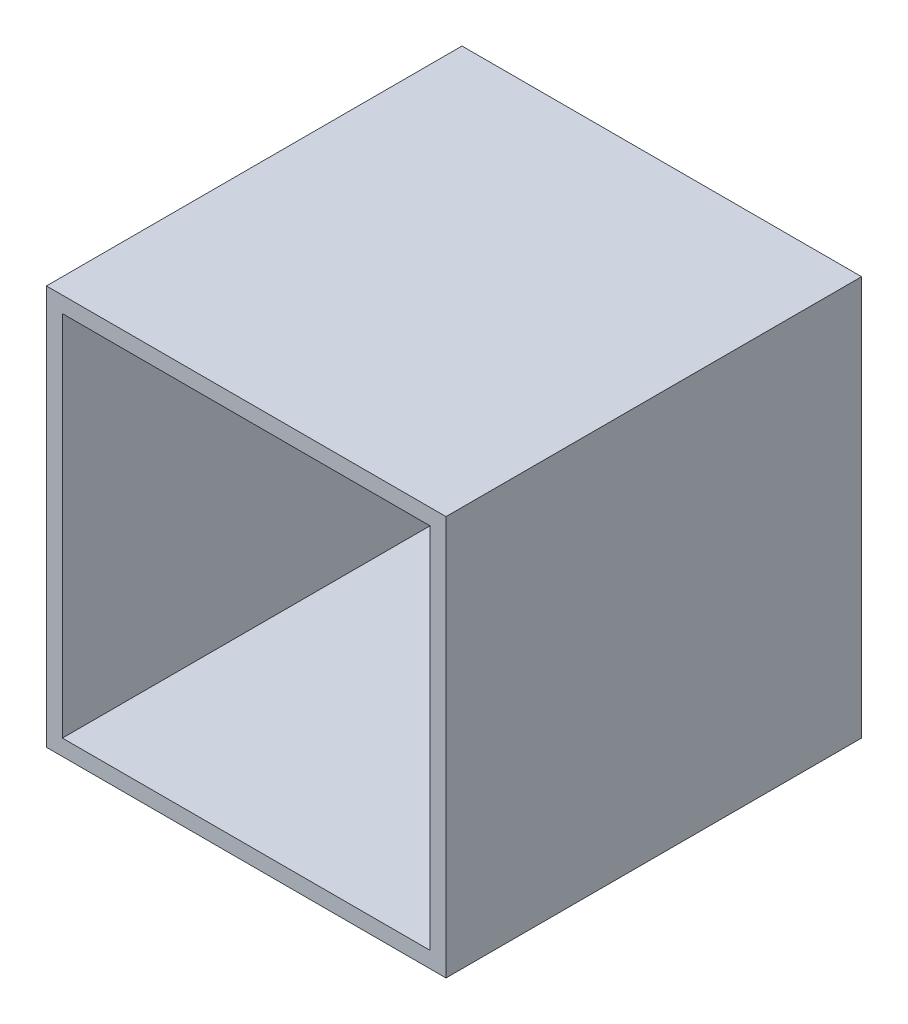
ISO-10303-21;
HEADER;
FILE_DESCRIPTION(('STEP AP214'),'2;1');
FILE_NAME('part.step','',(''),(''),'','','');
FILE_SCHEMA(('AUTOMOTIVE_DESIGN { 1 0 10303 214 1 1 1 1 }'));
ENDSEC;
DATA;
#1=APPLICATION_CONTEXT('core data for automotive mechanical design processes');
#2=APPLICATION_PROTOCOL_DEFINITION('international standard','automotive_design',2000,#1);
#3=PRODUCT_CONTEXT('',#1,'mechanical');
#4=PRODUCT('Part','Part','',(#3));
#5=PRODUCT_RELATED_PRODUCT_CATEGORY('part','',(#4));
#6=PRODUCT_DEFINITION_FORMATION('','',#4);
#7=PRODUCT_DEFINITION_CONTEXT('part definition',#1,'design');
#8=PRODUCT_DEFINITION('design','',#6,#7);
#9=PRODUCT_DEFINITION_SHAPE('','',#8);
#10=(LENGTH_UNIT() NAMED_UNIT(*) SI_UNIT(.MILLI.,.METRE.));
#11=(NAMED_UNIT(*) PLANE_ANGLE_UNIT() SI_UNIT($,.RADIAN.));
#12=(NAMED_UNIT(*) SI_UNIT($,.STERADIAN.) SOLID_ANGLE_UNIT());
#13=UNCERTAINTY_MEASURE_WITH_UNIT(LENGTH_MEASURE(1.E-05),#10,'distance_accuracy_value','');
#14=(GEOMETRIC_REPRESENTATION_CONTEXT(3) GLOBAL_UNCERTAINTY_ASSIGNED_CONTEXT((#13)) GLOBAL_UNIT_ASSIGNED_CONTEXT((#10,
#11,#12)) REPRESENTATION_CONTEXT('',''));
#15=CARTESIAN_POINT('',(0.,0.,0.));
#16=DIRECTION('',(0.,0.,1.));
#17=DIRECTION('',(1.,0.,0.));
#18=AXIS2_PLACEMENT_3D('',#15,#16,#17);
#19=CARTESIAN_POINT('',(-77.8929494362751,38.1849315068493,52.));
#20=DIRECTION('',(1.,0.,0.));
#21=DIRECTION('',(0.,0.,-1.));
#22=AXIS2_PLACEMENT_3D('',#19,#20,#21);
#23=PLANE('',#22);
#24=DIRECTION('',(0.,-1.,0.));
#25=VECTOR('',#24,1.);
#26=CARTESIAN_POINT('',(-77.8929494362751,38.1849315068493,0.));
#27=LINE('',#26,#25);
#28=CARTESIAN_POINT('',(-77.8929494362751,38.1849315068493,0.));
#29=VERTEX_POINT('',#28);
#30=CARTESIAN_POINT('',(-77.8929494362751,-11.8150684931507,0.));
#31=VERTEX_POINT('',#30);
#32=EDGE_CURVE('E141',#29,#31,#27,.T.);
#33=ORIENTED_EDGE('',*,*,#32,.T.);
#34=DIRECTION('',(0.,0.,-1.));
#35=VECTOR('',#34,1.);
#36=CARTESIAN_POINT('',(-77.8929494362751,-11.8150684931507,52.));
#37=LINE('',#36,#35);
#38=CARTESIAN_POINT('',(-77.8929494362751,-11.8150684931507,52.));
#39=VERTEX_POINT('',#38);
#40=EDGE_CURVE('E11',#39,#31,#37,.T.);
#41=ORIENTED_EDGE('',*,*,#40,.F.);
#42=DIRECTION('',(0.,-1.,0.));
#43=VECTOR('',#42,1.);
#44=CARTESIAN_POINT('',(-77.8929494362751,38.1849315068493,52.));
#45=LINE('',#44,#43);
#46=CARTESIAN_POINT('',(-77.8929494362751,38.1849315068493,52.));
#47=VERTEX_POINT('',#46);
#48=EDGE_CURVE('E145',#47,#39,#45,.T.);
#49=ORIENTED_EDGE('',*,*,#48,.F.);
#50=DIRECTION('',(0.,0.,-1.));
#51=VECTOR('',#50,1.);
#52=CARTESIAN_POINT('',(-77.8929494362751,38.1849315068493,52.));
#53=LINE('',#52,#51);
#54=EDGE_CURVE('E151',#47,#29,#53,.T.);
#55=ORIENTED_EDGE('',*,*,#54,.T.);
#56=EDGE_LOOP('',(#33,#41,#49,#55));
#57=FACE_BOUND('',#56,.T.);
#58=ADVANCED_FACE('F33',(#57),#23,.F.);
#59=CARTESIAN_POINT('',(-77.8929494362751,-11.8150684931507,52.));
#60=DIRECTION('',(0.,1.,0.));
#61=DIRECTION('',(0.,0.,1.));
#62=AXIS2_PLACEMENT_3D('',#59,#60,#61);
#63=PLANE('',#62);
#64=DIRECTION('',(1.,0.,0.));
#65=VECTOR('',#64,1.);
#66=CARTESIAN_POINT('',(-77.8929494362751,-11.8150684931507,0.));
#67=LINE('',#66,#65);
#68=CARTESIAN_POINT('',(-27.8929494362751,-11.8150684931507,0.));
#69=VERTEX_POINT('',#68);
#70=EDGE_CURVE('E154',#31,#69,#67,.T.);
#71=ORIENTED_EDGE('',*,*,#70,.T.);
#72=DIRECTION('',(0.,0.,-1.));
#73=VECTOR('',#72,1.);
#74=CARTESIAN_POINT('',(-27.8929494362751,-11.8150684931507,52.));
#75=LINE('',#74,#73);
#76=CARTESIAN_POINT('',(-27.8929494362751,-11.8150684931507,52.));
#77=VERTEX_POINT('',#76);
#78=EDGE_CURVE('E40',#77,#69,#75,.T.);
#79=ORIENTED_EDGE('',*,*,#78,.F.);
#80=DIRECTION('',(1.,0.,0.));
#81=VECTOR('',#80,1.);
#82=CARTESIAN_POINT('',(-77.8929494362751,-11.8150684931507,52.));
#83=LINE('',#82,#81);
#84=EDGE_CURVE('E84',#39,#77,#83,.T.);
#85=ORIENTED_EDGE('',*,*,#84,.F.);
#86=ORIENTED_EDGE('',*,*,#40,.T.);
#87=EDGE_LOOP('',(#71,#79,#85,#86));
#88=FACE_BOUND('',#87,.T.);
#89=ADVANCED_FACE('F183',(#88),#63,.F.);
#90=CARTESIAN_POINT('',(-27.8929494362751,38.1849315068493,52.));
#91=DIRECTION('',(-1.,0.,0.));
#92=DIRECTION('',(0.,-1.,0.));
#93=AXIS2_PLACEMENT_3D('',#90,#91,#92);
#94=PLANE('',#93);
#95=DIRECTION('',(0.,1.,0.));
#96=VECTOR('',#95,1.);
#97=CARTESIAN_POINT('',(-27.8929494362751,38.1849315068493,0.));
#98=LINE('',#97,#96);
#99=CARTESIAN_POINT('',(-27.8929494362751,38.1849315068493,0.));
#100=VERTEX_POINT('',#99);
#101=EDGE_CURVE('E156',#69,#100,#98,.T.);
#102=ORIENTED_EDGE('',*,*,#101,.T.);
#103=DIRECTION('',(0.,0.,-1.));
#104=VECTOR('',#103,1.);
#105=CARTESIAN_POINT('',(-27.8929494362751,38.1849315068493,52.));
#106=LINE('',#105,#104);
#107=CARTESIAN_POINT('',(-27.8929494362751,38.1849315068493,52.));
#108=VERTEX_POINT('',#107);
#109=EDGE_CURVE('E160',#108,#100,#106,.T.);
#110=ORIENTED_EDGE('',*,*,#109,.F.);
#111=DIRECTION('',(0.,1.,0.));
#112=VECTOR('',#111,1.);
#113=CARTESIAN_POINT('',(-27.8929494362751,38.1849315068493,52.));
#114=LINE('',#113,#112);
#115=EDGE_CURVE('E148',#77,#108,#114,.T.);
#116=ORIENTED_EDGE('',*,*,#115,.F.);
#117=ORIENTED_EDGE('',*,*,#78,.T.);
#118=EDGE_LOOP('',(#102,#110,#116,#117));
#119=FACE_BOUND('',#118,.T.);
#120=ADVANCED_FACE('F165',(#119),#94,.F.);
#121=CARTESIAN_POINT('',(-77.8929494362751,38.1849315068493,52.));
#122=DIRECTION('',(0.,-1.,0.));
#123=DIRECTION('',(0.,0.,-1.));
#124=AXIS2_PLACEMENT_3D('',#121,#122,#123);
#125=PLANE('',#124);
#126=DIRECTION('',(-1.,0.,0.));
#127=VECTOR('',#126,1.);
#128=CARTESIAN_POINT('',(-77.8929494362751,38.1849315068493,0.));
#129=LINE('',#128,#127);
#130=EDGE_CURVE('E77',#100,#29,#129,.T.);
#131=ORIENTED_EDGE('',*,*,#130,.T.);
#132=ORIENTED_EDGE('',*,*,#54,.F.);
#133=DIRECTION('',(-1.,0.,0.));
#134=VECTOR('',#133,1.);
#135=CARTESIAN_POINT('',(-77.8929494362751,38.1849315068493,52.));
#136=LINE('',#135,#134);
#137=EDGE_CURVE('E56',#108,#47,#136,.T.);
#138=ORIENTED_EDGE('',*,*,#137,.F.);
#139=ORIENTED_EDGE('',*,*,#109,.T.);
#140=EDGE_LOOP('',(#131,#132,#138,#139));
#141=FACE_BOUND('',#140,.T.);
#142=ADVANCED_FACE('F173',(#141),#125,.F.);
#143=CARTESIAN_POINT('',(0.,0.,52.));
#144=DIRECTION('',(0.,0.,1.));
#145=DIRECTION('',(1.,0.,0.));
#146=AXIS2_PLACEMENT_3D('',#143,#144,#145);
#147=PLANE('',#146);
#148=DIRECTION('',(0.,1.,0.));
#149=VECTOR('',#148,1.);
#150=CARTESIAN_POINT('',(-29.8929494362751,-9.81506849315068,52.));
#151=LINE('',#150,#149);
#152=CARTESIAN_POINT('',(-29.8929494362751,-9.81506849315068,52.));
#153=VERTEX_POINT('',#152);
#154=CARTESIAN_POINT('',(-29.8929494362751,36.1849315068493,52.));
#155=VERTEX_POINT('',#154);
#156=EDGE_CURVE('E47',#153,#155,#151,.T.);
#157=ORIENTED_EDGE('',*,*,#156,.F.);
#158=DIRECTION('',(1.,0.,0.));
#159=VECTOR('',#158,1.);
#160=CARTESIAN_POINT('',(-75.8929494362751,-9.81506849315068,52.));
#161=LINE('',#160,#159);
#162=CARTESIAN_POINT('',(-75.8929494362751,-9.81506849315068,52.));
#163=VERTEX_POINT('',#162);
#164=EDGE_CURVE('E126',#163,#153,#161,.T.);
#165=ORIENTED_EDGE('',*,*,#164,.F.);
#166=DIRECTION('',(0.,-1.,0.));
#167=VECTOR('',#166,1.);
#168=CARTESIAN_POINT('',(-75.8929494362751,-9.81506849315068,52.));
#169=LINE('',#168,#167);
#170=CARTESIAN_POINT('',(-75.8929494362751,36.1849315068493,52.));
#171=VERTEX_POINT('',#170);
#172=EDGE_CURVE('E129',#171,#163,#169,.T.);
#173=ORIENTED_EDGE('',*,*,#172,.F.);
#174=DIRECTION('',(-1.,0.,0.));
#175=VECTOR('',#174,1.);
#176=CARTESIAN_POINT('',(-75.8929494362751,36.1849315068493,52.));
#177=LINE('',#176,#175);
#178=EDGE_CURVE('E135',#155,#171,#177,.T.);
#179=ORIENTED_EDGE('',*,*,#178,.F.);
#180=EDGE_LOOP('',(#157,#165,#173,#179));
#181=FACE_BOUND('',#180,.T.);
#182=ORIENTED_EDGE('',*,*,#48,.T.);
#183=ORIENTED_EDGE('',*,*,#84,.T.);
#184=ORIENTED_EDGE('',*,*,#115,.T.);
#185=ORIENTED_EDGE('',*,*,#137,.T.);
#186=EDGE_LOOP('',(#182,#183,#184,#185));
#187=FACE_BOUND('',#186,.T.);
#188=ADVANCED_FACE('F175',(#181,#187),#147,.T.);
#189=CARTESIAN_POINT('',(0.,0.,0.));
#190=DIRECTION('',(0.,0.,1.));
#191=DIRECTION('',(1.,0.,0.));
#192=AXIS2_PLACEMENT_3D('',#189,#190,#191);
#193=PLANE('',#192);
#194=ORIENTED_EDGE('',*,*,#32,.F.);
#195=ORIENTED_EDGE('',*,*,#130,.F.);
#196=ORIENTED_EDGE('',*,*,#101,.F.);
#197=ORIENTED_EDGE('',*,*,#70,.F.);
#198=EDGE_LOOP('',(#194,#195,#196,#197));
#199=FACE_BOUND('',#198,.T.);
#200=ADVANCED_FACE('F169',(#199),#193,.F.);
#201=CARTESIAN_POINT('',(-29.8929494362751,-9.81506849315068,1.99999999999999));
#202=DIRECTION('',(1.,0.,0.));
#203=DIRECTION('',(0.,0.,-1.));
#204=AXIS2_PLACEMENT_3D('',#201,#202,#203);
#205=PLANE('',#204);
#206=ORIENTED_EDGE('',*,*,#156,.T.);
#207=DIRECTION('',(0.,0.,1.));
#208=VECTOR('',#207,1.);
#209=CARTESIAN_POINT('',(-29.8929494362751,36.1849315068493,1.99999999999999));
#210=LINE('',#209,#208);
#211=CARTESIAN_POINT('',(-29.8929494362751,36.1849315068493,1.99999999999999));
#212=VERTEX_POINT('',#211);
#213=EDGE_CURVE('E104',#212,#155,#210,.T.);
#214=ORIENTED_EDGE('',*,*,#213,.F.);
#215=DIRECTION('',(0.,1.,0.));
#216=VECTOR('',#215,1.);
#217=CARTESIAN_POINT('',(-29.8929494362751,-9.81506849315068,1.99999999999999));
#218=LINE('',#217,#216);
#219=CARTESIAN_POINT('',(-29.8929494362751,-9.81506849315068,1.99999999999999));
#220=VERTEX_POINT('',#219);
#221=EDGE_CURVE('E108',#220,#212,#218,.T.);
#222=ORIENTED_EDGE('',*,*,#221,.F.);
#223=DIRECTION('',(0.,0.,1.));
#224=VECTOR('',#223,1.);
#225=CARTESIAN_POINT('',(-29.8929494362751,-9.81506849315068,1.99999999999999));
#226=LINE('',#225,#224);
#227=EDGE_CURVE('E139',#220,#153,#226,.T.);
#228=ORIENTED_EDGE('',*,*,#227,.T.);
#229=EDGE_LOOP('',(#206,#214,#222,#228));
#230=FACE_BOUND('',#229,.T.);
#231=ADVANCED_FACE('F106',(#230),#205,.F.);
#232=CARTESIAN_POINT('',(-75.8929494362751,-9.81506849315068,1.99999999999999));
#233=DIRECTION('',(0.,-1.,0.));
#234=DIRECTION('',(0.,0.,-1.));
#235=AXIS2_PLACEMENT_3D('',#232,#233,#234);
#236=PLANE('',#235);
#237=ORIENTED_EDGE('',*,*,#164,.T.);
#238=ORIENTED_EDGE('',*,*,#227,.F.);
#239=DIRECTION('',(1.,0.,0.));
#240=VECTOR('',#239,1.);
#241=CARTESIAN_POINT('',(-75.8929494362751,-9.81506849315068,1.99999999999999));
#242=LINE('',#241,#240);
#243=CARTESIAN_POINT('',(-75.8929494362751,-9.81506849315068,1.99999999999999));
#244=VERTEX_POINT('',#243);
#245=EDGE_CURVE('E114',#244,#220,#242,.T.);
#246=ORIENTED_EDGE('',*,*,#245,.F.);
#247=DIRECTION('',(0.,0.,1.));
#248=VECTOR('',#247,1.);
#249=CARTESIAN_POINT('',(-75.8929494362751,-9.81506849315068,1.99999999999999));
#250=LINE('',#249,#248);
#251=EDGE_CURVE('E142',#244,#163,#250,.T.);
#252=ORIENTED_EDGE('',*,*,#251,.T.);
#253=EDGE_LOOP('',(#237,#238,#246,#252));
#254=FACE_BOUND('',#253,.T.);
#255=ADVANCED_FACE('F222',(#254),#236,.F.);
#256=CARTESIAN_POINT('',(-75.8929494362751,-9.81506849315068,1.99999999999999));
#257=DIRECTION('',(-1.,0.,0.));
#258=DIRECTION('',(0.,0.,1.));
#259=AXIS2_PLACEMENT_3D('',#256,#257,#258);
#260=PLANE('',#259);
#261=ORIENTED_EDGE('',*,*,#172,.T.);
#262=ORIENTED_EDGE('',*,*,#251,.F.);
#263=DIRECTION('',(0.,-1.,0.));
#264=VECTOR('',#263,1.);
#265=CARTESIAN_POINT('',(-75.8929494362751,-9.81506849315068,1.99999999999999));
#266=LINE('',#265,#264);
#267=CARTESIAN_POINT('',(-75.8929494362751,36.1849315068493,1.99999999999999));
#268=VERTEX_POINT('',#267);
#269=EDGE_CURVE('E122',#268,#244,#266,.T.);
#270=ORIENTED_EDGE('',*,*,#269,.F.);
#271=DIRECTION('',(0.,0.,1.));
#272=VECTOR('',#271,1.);
#273=CARTESIAN_POINT('',(-75.8929494362751,36.1849315068493,1.99999999999999));
#274=LINE('',#273,#272);
#275=EDGE_CURVE('E113',#268,#171,#274,.T.);
#276=ORIENTED_EDGE('',*,*,#275,.T.);
#277=EDGE_LOOP('',(#261,#262,#270,#276));
#278=FACE_BOUND('',#277,.T.);
#279=ADVANCED_FACE('F231',(#278),#260,.F.);
#280=CARTESIAN_POINT('',(-75.8929494362751,36.1849315068493,1.99999999999999));
#281=DIRECTION('',(0.,1.,0.));
#282=DIRECTION('',(0.,0.,1.));
#283=AXIS2_PLACEMENT_3D('',#280,#281,#282);
#284=PLANE('',#283);
#285=ORIENTED_EDGE('',*,*,#178,.T.);
#286=ORIENTED_EDGE('',*,*,#275,.F.);
#287=DIRECTION('',(-1.,0.,0.));
#288=VECTOR('',#287,1.);
#289=CARTESIAN_POINT('',(-75.8929494362751,36.1849315068493,1.99999999999999));
#290=LINE('',#289,#288);
#291=EDGE_CURVE('E117',#212,#268,#290,.T.);
#292=ORIENTED_EDGE('',*,*,#291,.F.);
#293=ORIENTED_EDGE('',*,*,#213,.T.);
#294=EDGE_LOOP('',(#285,#286,#292,#293));
#295=FACE_BOUND('',#294,.T.);
#296=ADVANCED_FACE('F118',(#295),#284,.F.);
#297=CARTESIAN_POINT('',(0.,0.,1.99999999999999));
#298=DIRECTION('',(0.,0.,-1.));
#299=DIRECTION('',(-1.,0.,0.));
#300=AXIS2_PLACEMENT_3D('',#297,#298,#299);
#301=PLANE('',#300);
#302=ORIENTED_EDGE('',*,*,#221,.T.);
#303=ORIENTED_EDGE('',*,*,#291,.T.);
#304=ORIENTED_EDGE('',*,*,#269,.T.);
#305=ORIENTED_EDGE('',*,*,#245,.T.);
#306=EDGE_LOOP('',(#302,#303,#304,#305));
#307=FACE_BOUND('',#306,.T.);
#308=ADVANCED_FACE('F124',(#307),#301,.F.);
#309=CLOSED_SHELL('',(#58,#89,#120,#142,#188,#200,#231,#255,#279,#296,#308));
#310=MANIFOLD_SOLID_BREP('B2',#309);
#311=ADVANCED_BREP_SHAPE_REPRESENTATION('',(#18,#310),#14);
#312=SHAPE_DEFINITION_REPRESENTATION(#9,#311);
ENDSEC;
END-ISO-10303-21;
